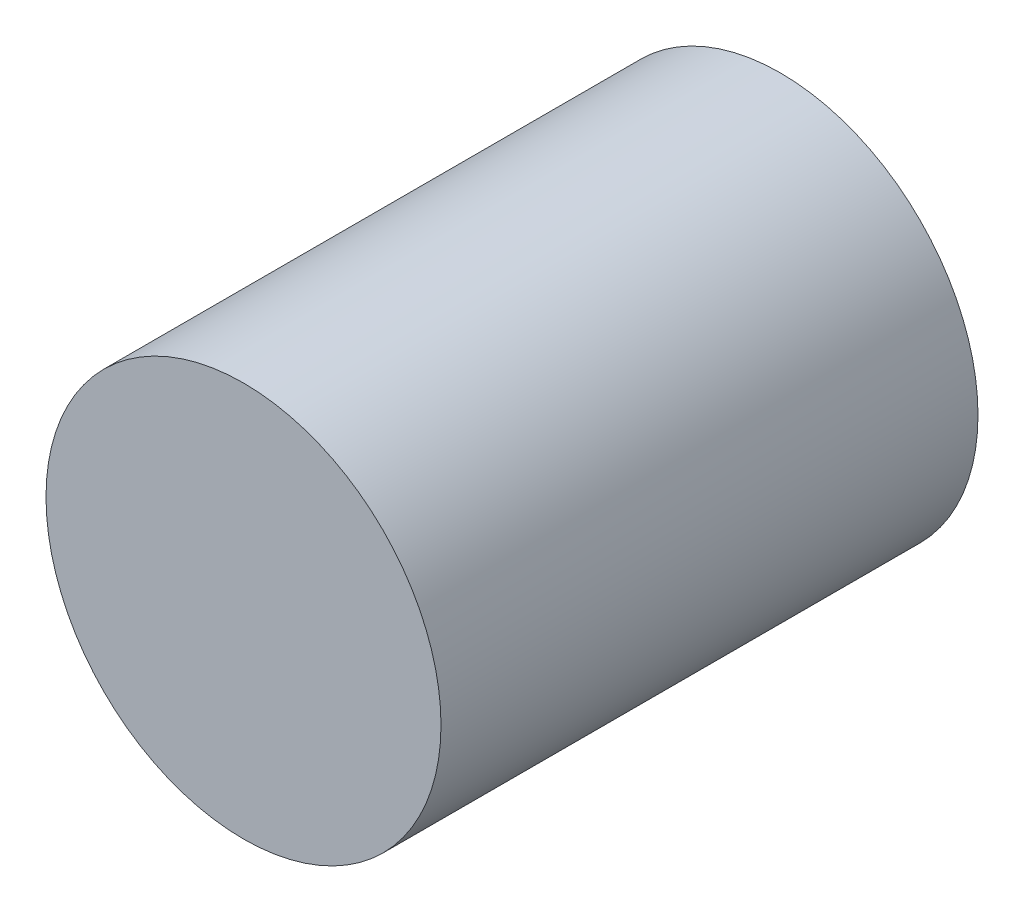
ISO-10303-21;
HEADER;
FILE_DESCRIPTION(('STEP AP214'),'2;1');
FILE_NAME('part.step','',(''),(''),'','','');
FILE_SCHEMA(('AUTOMOTIVE_DESIGN { 1 0 10303 214 1 1 1 1 }'));
ENDSEC;
DATA;
#1=APPLICATION_CONTEXT('core data for automotive mechanical design processes');
#2=APPLICATION_PROTOCOL_DEFINITION('international standard','automotive_design',2000,#1);
#3=PRODUCT_CONTEXT('',#1,'mechanical');
#4=PRODUCT('Part','Part','',(#3));
#5=PRODUCT_RELATED_PRODUCT_CATEGORY('part','',(#4));
#6=PRODUCT_DEFINITION_FORMATION('','',#4);
#7=PRODUCT_DEFINITION_CONTEXT('part definition',#1,'design');
#8=PRODUCT_DEFINITION('design','',#6,#7);
#9=PRODUCT_DEFINITION_SHAPE('','',#8);
#10=(LENGTH_UNIT() NAMED_UNIT(*) SI_UNIT(.MILLI.,.METRE.));
#11=(NAMED_UNIT(*) PLANE_ANGLE_UNIT() SI_UNIT($,.RADIAN.));
#12=(NAMED_UNIT(*) SI_UNIT($,.STERADIAN.) SOLID_ANGLE_UNIT());
#13=UNCERTAINTY_MEASURE_WITH_UNIT(LENGTH_MEASURE(1.E-05),#10,'distance_accuracy_value','');
#14=(GEOMETRIC_REPRESENTATION_CONTEXT(3) GLOBAL_UNCERTAINTY_ASSIGNED_CONTEXT((#13)) GLOBAL_UNIT_ASSIGNED_CONTEXT((#10,
#11,#12)) REPRESENTATION_CONTEXT('',''));
#15=CARTESIAN_POINT('',(0.,0.,0.));
#16=DIRECTION('',(0.,0.,1.));
#17=DIRECTION('',(1.,0.,0.));
#18=AXIS2_PLACEMENT_3D('',#15,#16,#17);
#19=CARTESIAN_POINT('',(0.,0.,57.1));
#20=DIRECTION('',(0.,0.,-1.));
#21=DIRECTION('',(-1.,0.,0.));
#22=AXIS2_PLACEMENT_3D('',#19,#20,#21);
#23=CYLINDRICAL_SURFACE('',#22,21.);
#24=CARTESIAN_POINT('',(0.,0.,57.1));
#25=DIRECTION('',(0.,0.,1.));
#26=DIRECTION('',(1.,0.,0.));
#27=AXIS2_PLACEMENT_3D('',#24,#25,#26);
#28=CIRCLE('',#27,21.);
#29=CARTESIAN_POINT('',(21.,0.,57.1));
#30=VERTEX_POINT('',#29);
#31=EDGE_CURVE('E10',#30,#30,#28,.T.);
#32=ORIENTED_EDGE('',*,*,#31,.F.);
#33=EDGE_LOOP('',(#32));
#34=FACE_BOUND('',#33,.T.);
#35=CARTESIAN_POINT('',(0.,0.,0.));
#36=DIRECTION('',(0.,0.,1.));
#37=DIRECTION('',(1.,0.,0.));
#38=AXIS2_PLACEMENT_3D('',#35,#36,#37);
#39=CIRCLE('',#38,21.);
#40=CARTESIAN_POINT('',(21.,0.,0.));
#41=VERTEX_POINT('',#40);
#42=EDGE_CURVE('E38',#41,#41,#39,.T.);
#43=ORIENTED_EDGE('',*,*,#42,.T.);
#44=EDGE_LOOP('',(#43));
#45=FACE_BOUND('',#44,.T.);
#46=ADVANCED_FACE('F35',(#34,#45),#23,.T.);
#47=CARTESIAN_POINT('',(0.,0.,57.1));
#48=DIRECTION('',(0.,0.,1.));
#49=DIRECTION('',(1.,0.,0.));
#50=AXIS2_PLACEMENT_3D('',#47,#48,#49);
#51=PLANE('',#50);
#52=ORIENTED_EDGE('',*,*,#31,.T.);
#53=EDGE_LOOP('',(#52));
#54=FACE_BOUND('',#53,.T.);
#55=ADVANCED_FACE('F50',(#54),#51,.T.);
#56=CARTESIAN_POINT('',(0.,0.,0.));
#57=DIRECTION('',(0.,0.,1.));
#58=DIRECTION('',(1.,0.,0.));
#59=AXIS2_PLACEMENT_3D('',#56,#57,#58);
#60=PLANE('',#59);
#61=ORIENTED_EDGE('',*,*,#42,.F.);
#62=EDGE_LOOP('',(#61));
#63=FACE_BOUND('',#62,.T.);
#64=ADVANCED_FACE('F48',(#63),#60,.F.);
#65=CLOSED_SHELL('',(#46,#55,#64));
#66=MANIFOLD_SOLID_BREP('B2',#65);
#67=ADVANCED_BREP_SHAPE_REPRESENTATION('',(#18,#66),#14);
#68=SHAPE_DEFINITION_REPRESENTATION(#9,#67);
ENDSEC;
END-ISO-10303-21;
